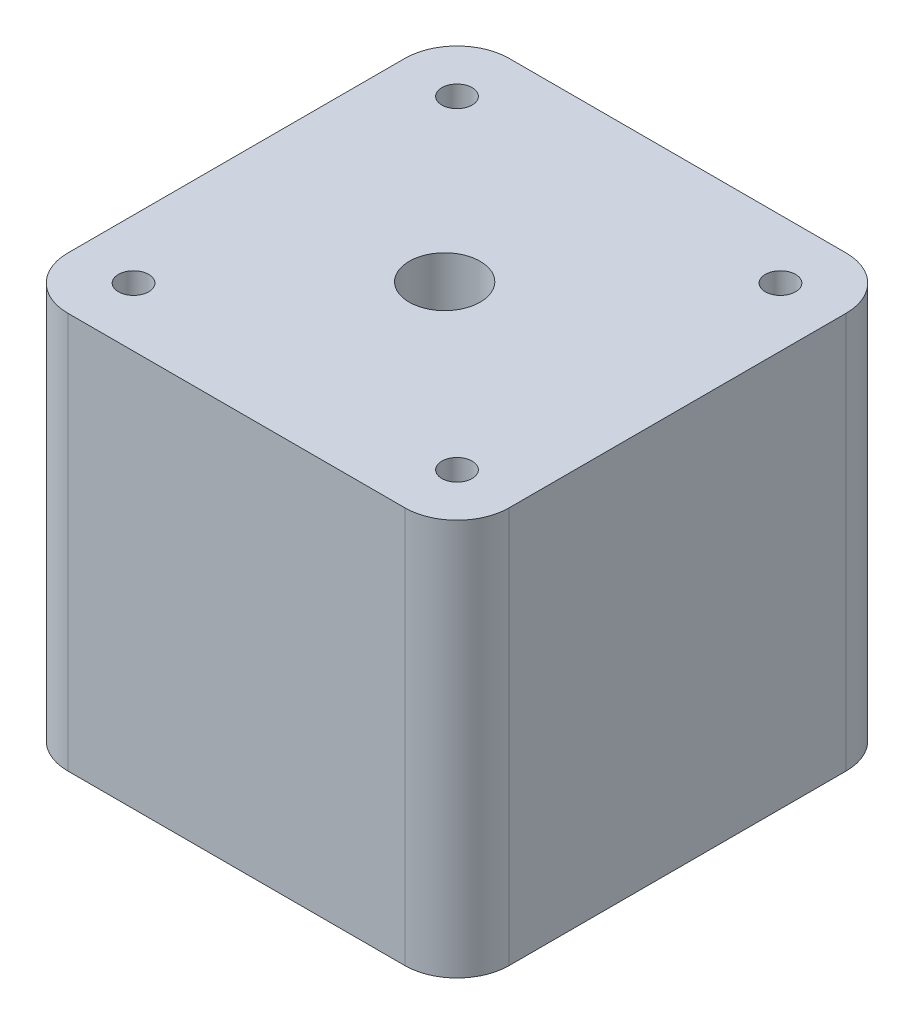
ISO-10303-21;
HEADER;
FILE_DESCRIPTION(('STEP AP214'),'2;1');
FILE_NAME('part.step','',(''),(''),'','','');
FILE_SCHEMA(('AUTOMOTIVE_DESIGN { 1 0 10303 214 1 1 1 1 }'));
ENDSEC;
DATA;
#1=APPLICATION_CONTEXT('core data for automotive mechanical design processes');
#2=APPLICATION_PROTOCOL_DEFINITION('international standard','automotive_design',2000,#1);
#3=PRODUCT_CONTEXT('',#1,'mechanical');
#4=PRODUCT('Part','Part','',(#3));
#5=PRODUCT_RELATED_PRODUCT_CATEGORY('part','',(#4));
#6=PRODUCT_DEFINITION_FORMATION('','',#4);
#7=PRODUCT_DEFINITION_CONTEXT('part definition',#1,'design');
#8=PRODUCT_DEFINITION('design','',#6,#7);
#9=PRODUCT_DEFINITION_SHAPE('','',#8);
#10=(LENGTH_UNIT() NAMED_UNIT(*) SI_UNIT(.MILLI.,.METRE.));
#11=(NAMED_UNIT(*) PLANE_ANGLE_UNIT() SI_UNIT($,.RADIAN.));
#12=(NAMED_UNIT(*) SI_UNIT($,.STERADIAN.) SOLID_ANGLE_UNIT());
#13=UNCERTAINTY_MEASURE_WITH_UNIT(LENGTH_MEASURE(1.E-05),#10,'distance_accuracy_value','');
#14=(GEOMETRIC_REPRESENTATION_CONTEXT(3) GLOBAL_UNCERTAINTY_ASSIGNED_CONTEXT((#13)) GLOBAL_UNIT_ASSIGNED_CONTEXT((#10,
#11,#12)) REPRESENTATION_CONTEXT('',''));
#15=CARTESIAN_POINT('',(0.,0.,0.));
#16=DIRECTION('',(0.,0.,1.));
#17=DIRECTION('',(1.,0.,0.));
#18=AXIS2_PLACEMENT_3D('',#15,#16,#17);
#19=CARTESIAN_POINT('',(-22.1398895339047,38.,27.3268437601062));
#20=DIRECTION('',(0.,-1.,0.));
#21=DIRECTION('',(0.,0.,-1.));
#22=AXIS2_PLACEMENT_3D('',#19,#20,#21);
#23=CYLINDRICAL_SURFACE('',#22,5.);
#24=CARTESIAN_POINT('',(-22.1398895339047,0.,27.3268437601062));
#25=DIRECTION('',(0.,1.,0.));
#26=DIRECTION('',(0.,0.,1.));
#27=AXIS2_PLACEMENT_3D('',#24,#25,#26);
#28=CIRCLE('',#27,5.);
#29=CARTESIAN_POINT('',(-27.1398895339047,0.,27.3268437601062));
#30=VERTEX_POINT('',#29);
#31=CARTESIAN_POINT('',(-22.1398895339046,0.,32.3268437601062));
#32=VERTEX_POINT('',#31);
#33=EDGE_CURVE('E134',#30,#32,#28,.T.);
#34=ORIENTED_EDGE('',*,*,#33,.T.);
#35=DIRECTION('',(0.,-1.,0.));
#36=VECTOR('',#35,1.);
#37=CARTESIAN_POINT('',(-22.1398895339046,38.,32.3268437601062));
#38=LINE('',#37,#36);
#39=CARTESIAN_POINT('',(-22.1398895339046,38.,32.3268437601062));
#40=VERTEX_POINT('',#39);
#41=EDGE_CURVE('E11',#40,#32,#38,.T.);
#42=ORIENTED_EDGE('',*,*,#41,.F.);
#43=CARTESIAN_POINT('',(-22.1398895339047,38.,27.3268437601062));
#44=DIRECTION('',(0.,1.,0.));
#45=DIRECTION('',(0.,0.,1.));
#46=AXIS2_PLACEMENT_3D('',#43,#44,#45);
#47=CIRCLE('',#46,5.);
#48=CARTESIAN_POINT('',(-27.1398895339047,38.,27.3268437601062));
#49=VERTEX_POINT('',#48);
#50=EDGE_CURVE('E149',#49,#40,#47,.T.);
#51=ORIENTED_EDGE('',*,*,#50,.F.);
#52=DIRECTION('',(0.,-1.,0.));
#53=VECTOR('',#52,1.);
#54=CARTESIAN_POINT('',(-27.1398895339047,38.,27.3268437601062));
#55=LINE('',#54,#53);
#56=EDGE_CURVE('E130',#49,#30,#55,.T.);
#57=ORIENTED_EDGE('',*,*,#56,.T.);
#58=EDGE_LOOP('',(#34,#42,#51,#57));
#59=FACE_BOUND('',#58,.T.);
#60=ADVANCED_FACE('F35',(#59),#23,.T.);
#61=CARTESIAN_POINT('',(-22.1398895339046,38.,32.3268437601062));
#62=DIRECTION('',(0.,0.,-1.));
#63=DIRECTION('',(-1.,0.,0.));
#64=AXIS2_PLACEMENT_3D('',#61,#62,#63);
#65=PLANE('',#64);
#66=DIRECTION('',(1.,0.,0.));
#67=VECTOR('',#66,1.);
#68=CARTESIAN_POINT('',(-22.1398895339046,0.,32.3268437601062));
#69=LINE('',#68,#67);
#70=CARTESIAN_POINT('',(10.1601104660953,0.,32.3268437601062));
#71=VERTEX_POINT('',#70);
#72=EDGE_CURVE('E137',#32,#71,#69,.T.);
#73=ORIENTED_EDGE('',*,*,#72,.T.);
#74=DIRECTION('',(0.,-1.,0.));
#75=VECTOR('',#74,1.);
#76=CARTESIAN_POINT('',(10.1601104660953,38.,32.3268437601062));
#77=LINE('',#76,#75);
#78=CARTESIAN_POINT('',(10.1601104660953,38.,32.3268437601062));
#79=VERTEX_POINT('',#78);
#80=EDGE_CURVE('E43',#79,#71,#77,.T.);
#81=ORIENTED_EDGE('',*,*,#80,.F.);
#82=DIRECTION('',(1.,0.,0.));
#83=VECTOR('',#82,1.);
#84=CARTESIAN_POINT('',(-22.1398895339046,38.,32.3268437601062));
#85=LINE('',#84,#83);
#86=EDGE_CURVE('E95',#40,#79,#85,.T.);
#87=ORIENTED_EDGE('',*,*,#86,.F.);
#88=ORIENTED_EDGE('',*,*,#41,.T.);
#89=EDGE_LOOP('',(#73,#81,#87,#88));
#90=FACE_BOUND('',#89,.T.);
#91=ADVANCED_FACE('F243',(#90),#65,.F.);
#92=CARTESIAN_POINT('',(10.1601104660953,38.,27.3268437601062));
#93=DIRECTION('',(0.,-1.,0.));
#94=DIRECTION('',(0.,0.,-1.));
#95=AXIS2_PLACEMENT_3D('',#92,#93,#94);
#96=CYLINDRICAL_SURFACE('',#95,5.);
#97=CARTESIAN_POINT('',(10.1601104660953,0.,27.3268437601062));
#98=DIRECTION('',(0.,1.,0.));
#99=DIRECTION('',(0.,0.,1.));
#100=AXIS2_PLACEMENT_3D('',#97,#98,#99);
#101=CIRCLE('',#100,5.);
#102=CARTESIAN_POINT('',(15.1601104660953,0.,27.3268437601062));
#103=VERTEX_POINT('',#102);
#104=EDGE_CURVE('E140',#71,#103,#101,.T.);
#105=ORIENTED_EDGE('',*,*,#104,.T.);
#106=DIRECTION('',(0.,-1.,0.));
#107=VECTOR('',#106,1.);
#108=CARTESIAN_POINT('',(15.1601104660953,38.,27.3268437601062));
#109=LINE('',#108,#107);
#110=CARTESIAN_POINT('',(15.1601104660953,38.,27.3268437601062));
#111=VERTEX_POINT('',#110);
#112=EDGE_CURVE('E156',#111,#103,#109,.T.);
#113=ORIENTED_EDGE('',*,*,#112,.F.);
#114=CARTESIAN_POINT('',(10.1601104660953,38.,27.3268437601062));
#115=DIRECTION('',(0.,1.,0.));
#116=DIRECTION('',(0.,0.,1.));
#117=AXIS2_PLACEMENT_3D('',#114,#115,#116);
#118=CIRCLE('',#117,5.);
#119=EDGE_CURVE('E164',#79,#111,#118,.T.);
#120=ORIENTED_EDGE('',*,*,#119,.F.);
#121=ORIENTED_EDGE('',*,*,#80,.T.);
#122=EDGE_LOOP('',(#105,#113,#120,#121));
#123=FACE_BOUND('',#122,.T.);
#124=ADVANCED_FACE('F162',(#123),#96,.T.);
#125=CARTESIAN_POINT('',(15.1601104660953,38.,-4.97315623989379));
#126=DIRECTION('',(-1.,0.,0.));
#127=DIRECTION('',(0.,0.,1.));
#128=AXIS2_PLACEMENT_3D('',#125,#126,#127);
#129=PLANE('',#128);
#130=DIRECTION('',(0.,0.,-1.));
#131=VECTOR('',#130,1.);
#132=CARTESIAN_POINT('',(15.1601104660953,0.,-4.97315623989379));
#133=LINE('',#132,#131);
#134=CARTESIAN_POINT('',(15.1601104660953,0.,-4.97315623989379));
#135=VERTEX_POINT('',#134);
#136=EDGE_CURVE('E142',#103,#135,#133,.T.);
#137=ORIENTED_EDGE('',*,*,#136,.T.);
#138=DIRECTION('',(0.,-1.,0.));
#139=VECTOR('',#138,1.);
#140=CARTESIAN_POINT('',(15.1601104660953,38.,-4.97315623989379));
#141=LINE('',#140,#139);
#142=CARTESIAN_POINT('',(15.1601104660953,38.,-4.97315623989379));
#143=VERTEX_POINT('',#142);
#144=EDGE_CURVE('E153',#143,#135,#141,.T.);
#145=ORIENTED_EDGE('',*,*,#144,.F.);
#146=DIRECTION('',(0.,0.,-1.));
#147=VECTOR('',#146,1.);
#148=CARTESIAN_POINT('',(15.1601104660953,38.,-4.97315623989379));
#149=LINE('',#148,#147);
#150=EDGE_CURVE('E176',#111,#143,#149,.T.);
#151=ORIENTED_EDGE('',*,*,#150,.F.);
#152=ORIENTED_EDGE('',*,*,#112,.T.);
#153=EDGE_LOOP('',(#137,#145,#151,#152));
#154=FACE_BOUND('',#153,.T.);
#155=ADVANCED_FACE('F172',(#154),#129,.F.);
#156=CARTESIAN_POINT('',(10.1601104660953,38.,-4.97315623989379));
#157=DIRECTION('',(0.,-1.,0.));
#158=DIRECTION('',(0.,0.,-1.));
#159=AXIS2_PLACEMENT_3D('',#156,#157,#158);
#160=CYLINDRICAL_SURFACE('',#159,5.);
#161=CARTESIAN_POINT('',(10.1601104660953,0.,-4.97315623989379));
#162=DIRECTION('',(0.,1.,0.));
#163=DIRECTION('',(0.,0.,-1.));
#164=AXIS2_PLACEMENT_3D('',#161,#162,#163);
#165=CIRCLE('',#164,5.);
#166=CARTESIAN_POINT('',(10.1601104660953,0.,-9.97315623989379));
#167=VERTEX_POINT('',#166);
#168=EDGE_CURVE('E144',#135,#167,#165,.T.);
#169=ORIENTED_EDGE('',*,*,#168,.T.);
#170=DIRECTION('',(0.,-1.,0.));
#171=VECTOR('',#170,1.);
#172=CARTESIAN_POINT('',(10.1601104660953,38.,-9.97315623989379));
#173=LINE('',#172,#171);
#174=CARTESIAN_POINT('',(10.1601104660953,38.,-9.97315623989379));
#175=VERTEX_POINT('',#174);
#176=EDGE_CURVE('E125',#175,#167,#173,.T.);
#177=ORIENTED_EDGE('',*,*,#176,.F.);
#178=CARTESIAN_POINT('',(10.1601104660953,38.,-4.97315623989379));
#179=DIRECTION('',(0.,1.,0.));
#180=DIRECTION('',(0.,0.,-1.));
#181=AXIS2_PLACEMENT_3D('',#178,#179,#180);
#182=CIRCLE('',#181,5.);
#183=EDGE_CURVE('E116',#143,#175,#182,.T.);
#184=ORIENTED_EDGE('',*,*,#183,.F.);
#185=ORIENTED_EDGE('',*,*,#144,.T.);
#186=EDGE_LOOP('',(#169,#177,#184,#185));
#187=FACE_BOUND('',#186,.T.);
#188=ADVANCED_FACE('F175',(#187),#160,.T.);
#189=CARTESIAN_POINT('',(-22.1398895339047,38.,-9.97315623989379));
#190=DIRECTION('',(0.,0.,1.));
#191=DIRECTION('',(1.,0.,0.));
#192=AXIS2_PLACEMENT_3D('',#189,#190,#191);
#193=PLANE('',#192);
#194=DIRECTION('',(-1.,0.,0.));
#195=VECTOR('',#194,1.);
#196=CARTESIAN_POINT('',(-22.1398895339047,0.,-9.97315623989379));
#197=LINE('',#196,#195);
#198=CARTESIAN_POINT('',(-22.1398895339047,0.,-9.97315623989379));
#199=VERTEX_POINT('',#198);
#200=EDGE_CURVE('E124',#167,#199,#197,.T.);
#201=ORIENTED_EDGE('',*,*,#200,.T.);
#202=DIRECTION('',(0.,-1.,0.));
#203=VECTOR('',#202,1.);
#204=CARTESIAN_POINT('',(-22.1398895339047,38.,-9.97315623989379));
#205=LINE('',#204,#203);
#206=CARTESIAN_POINT('',(-22.1398895339047,38.,-9.97315623989379));
#207=VERTEX_POINT('',#206);
#208=EDGE_CURVE('E121',#207,#199,#205,.T.);
#209=ORIENTED_EDGE('',*,*,#208,.F.);
#210=DIRECTION('',(-1.,0.,0.));
#211=VECTOR('',#210,1.);
#212=CARTESIAN_POINT('',(-22.1398895339047,38.,-9.97315623989379));
#213=LINE('',#212,#211);
#214=EDGE_CURVE('E110',#175,#207,#213,.T.);
#215=ORIENTED_EDGE('',*,*,#214,.F.);
#216=ORIENTED_EDGE('',*,*,#176,.T.);
#217=EDGE_LOOP('',(#201,#209,#215,#216));
#218=FACE_BOUND('',#217,.T.);
#219=ADVANCED_FACE('F122',(#218),#193,.F.);
#220=CARTESIAN_POINT('',(-22.1398895339047,38.,-4.97315623989379));
#221=DIRECTION('',(0.,-1.,0.));
#222=DIRECTION('',(0.,0.,-1.));
#223=AXIS2_PLACEMENT_3D('',#220,#221,#222);
#224=CYLINDRICAL_SURFACE('',#223,5.);
#225=CARTESIAN_POINT('',(-22.1398895339047,0.,-4.97315623989379));
#226=DIRECTION('',(0.,1.,0.));
#227=DIRECTION('',(0.,0.,1.));
#228=AXIS2_PLACEMENT_3D('',#225,#226,#227);
#229=CIRCLE('',#228,5.);
#230=CARTESIAN_POINT('',(-27.1398895339047,0.,-4.97315623989379));
#231=VERTEX_POINT('',#230);
#232=EDGE_CURVE('E81',#199,#231,#229,.T.);
#233=ORIENTED_EDGE('',*,*,#232,.T.);
#234=DIRECTION('',(0.,-1.,0.));
#235=VECTOR('',#234,1.);
#236=CARTESIAN_POINT('',(-27.1398895339047,38.,-4.97315623989379));
#237=LINE('',#236,#235);
#238=CARTESIAN_POINT('',(-27.1398895339047,38.,-4.97315623989379));
#239=VERTEX_POINT('',#238);
#240=EDGE_CURVE('E126',#239,#231,#237,.T.);
#241=ORIENTED_EDGE('',*,*,#240,.F.);
#242=CARTESIAN_POINT('',(-22.1398895339047,38.,-4.97315623989379));
#243=DIRECTION('',(0.,1.,0.));
#244=DIRECTION('',(0.,0.,1.));
#245=AXIS2_PLACEMENT_3D('',#242,#243,#244);
#246=CIRCLE('',#245,5.);
#247=EDGE_CURVE('E114',#207,#239,#246,.T.);
#248=ORIENTED_EDGE('',*,*,#247,.F.);
#249=ORIENTED_EDGE('',*,*,#208,.T.);
#250=EDGE_LOOP('',(#233,#241,#248,#249));
#251=FACE_BOUND('',#250,.T.);
#252=ADVANCED_FACE('F128',(#251),#224,.T.);
#253=CARTESIAN_POINT('',(-27.1398895339047,38.,-4.97315623989379));
#254=DIRECTION('',(1.,0.,0.));
#255=DIRECTION('',(0.,0.,-1.));
#256=AXIS2_PLACEMENT_3D('',#253,#254,#255);
#257=PLANE('',#256);
#258=DIRECTION('',(0.,0.,1.));
#259=VECTOR('',#258,1.);
#260=CARTESIAN_POINT('',(-27.1398895339047,0.,-4.97315623989379));
#261=LINE('',#260,#259);
#262=EDGE_CURVE('E87',#231,#30,#261,.T.);
#263=ORIENTED_EDGE('',*,*,#262,.T.);
#264=ORIENTED_EDGE('',*,*,#56,.F.);
#265=DIRECTION('',(0.,0.,1.));
#266=VECTOR('',#265,1.);
#267=CARTESIAN_POINT('',(-27.1398895339047,38.,-4.97315623989379));
#268=LINE('',#267,#266);
#269=EDGE_CURVE('E51',#239,#49,#268,.T.);
#270=ORIENTED_EDGE('',*,*,#269,.F.);
#271=ORIENTED_EDGE('',*,*,#240,.T.);
#272=EDGE_LOOP('',(#263,#264,#270,#271));
#273=FACE_BOUND('',#272,.T.);
#274=ADVANCED_FACE('F216',(#273),#257,.F.);
#275=CARTESIAN_POINT('',(-22.1398895339047,38.,27.3268437601062));
#276=DIRECTION('',(0.,1.,0.));
#277=DIRECTION('',(0.,0.,1.));
#278=AXIS2_PLACEMENT_3D('',#275,#276,#277);
#279=PLANE('',#278);
#280=CARTESIAN_POINT('',(-6.693665391643,38.,11.6550677812531));
#281=DIRECTION('',(0.,1.,0.));
#282=DIRECTION('',(0.,0.,1.));
#283=AXIS2_PLACEMENT_3D('',#280,#281,#282);
#284=CIRCLE('',#283,3.4);
#285=CARTESIAN_POINT('',(-6.693665391643,38.,15.0550677812531));
#286=VERTEX_POINT('',#285);
#287=EDGE_CURVE('E208',#286,#286,#284,.T.);
#288=ORIENTED_EDGE('',*,*,#287,.F.);
#289=EDGE_LOOP('',(#288));
#290=FACE_BOUND('',#289,.T.);
#291=CARTESIAN_POINT('',(-21.4898895339047,38.,26.6768437601062));
#292=DIRECTION('',(0.,1.,0.));
#293=DIRECTION('',(0.,0.,1.));
#294=AXIS2_PLACEMENT_3D('',#291,#292,#293);
#295=CIRCLE('',#294,1.44999999999999);
#296=CARTESIAN_POINT('',(-21.4898895339047,38.,28.1268437601062));
#297=VERTEX_POINT('',#296);
#298=EDGE_CURVE('E202',#297,#297,#295,.T.);
#299=ORIENTED_EDGE('',*,*,#298,.F.);
#300=EDGE_LOOP('',(#299));
#301=FACE_BOUND('',#300,.T.);
#302=CARTESIAN_POINT('',(-21.4898895339047,38.,-4.32315623989379));
#303=DIRECTION('',(0.,1.,0.));
#304=DIRECTION('',(0.,0.,1.));
#305=AXIS2_PLACEMENT_3D('',#302,#303,#304);
#306=CIRCLE('',#305,1.44999999999999);
#307=CARTESIAN_POINT('',(-21.4898895339047,38.,-2.8731562398938));
#308=VERTEX_POINT('',#307);
#309=EDGE_CURVE('E196',#308,#308,#306,.T.);
#310=ORIENTED_EDGE('',*,*,#309,.F.);
#311=EDGE_LOOP('',(#310));
#312=FACE_BOUND('',#311,.T.);
#313=CARTESIAN_POINT('',(9.51011046609533,38.,-4.32315623989379));
#314=DIRECTION('',(0.,1.,0.));
#315=DIRECTION('',(0.,0.,1.));
#316=AXIS2_PLACEMENT_3D('',#313,#314,#315);
#317=CIRCLE('',#316,1.44999999999999);
#318=CARTESIAN_POINT('',(9.51011046609533,38.,-2.8731562398938));
#319=VERTEX_POINT('',#318);
#320=EDGE_CURVE('E190',#319,#319,#317,.T.);
#321=ORIENTED_EDGE('',*,*,#320,.F.);
#322=EDGE_LOOP('',(#321));
#323=FACE_BOUND('',#322,.T.);
#324=CARTESIAN_POINT('',(9.51011046609533,38.,26.6768437601062));
#325=DIRECTION('',(0.,1.,0.));
#326=DIRECTION('',(0.,0.,1.));
#327=AXIS2_PLACEMENT_3D('',#324,#325,#326);
#328=CIRCLE('',#327,1.44999999999999);
#329=CARTESIAN_POINT('',(9.51011046609533,38.,28.1268437601062));
#330=VERTEX_POINT('',#329);
#331=EDGE_CURVE('E184',#330,#330,#328,.T.);
#332=ORIENTED_EDGE('',*,*,#331,.F.);
#333=EDGE_LOOP('',(#332));
#334=FACE_BOUND('',#333,.T.);
#335=ORIENTED_EDGE('',*,*,#50,.T.);
#336=ORIENTED_EDGE('',*,*,#86,.T.);
#337=ORIENTED_EDGE('',*,*,#119,.T.);
#338=ORIENTED_EDGE('',*,*,#150,.T.);
#339=ORIENTED_EDGE('',*,*,#183,.T.);
#340=ORIENTED_EDGE('',*,*,#214,.T.);
#341=ORIENTED_EDGE('',*,*,#247,.T.);
#342=ORIENTED_EDGE('',*,*,#269,.T.);
#343=EDGE_LOOP('',(#335,#336,#337,#338,#339,#340,#341,#342));
#344=FACE_BOUND('',#343,.T.);
#345=ADVANCED_FACE('F112',(#290,#301,#312,#323,#334,#344),#279,.T.);
#346=CARTESIAN_POINT('',(-22.1398895339047,0.,27.3268437601062));
#347=DIRECTION('',(0.,1.,0.));
#348=DIRECTION('',(0.,0.,1.));
#349=AXIS2_PLACEMENT_3D('',#346,#347,#348);
#350=PLANE('',#349);
#351=CARTESIAN_POINT('',(-6.693665391643,0.,11.6550677812531));
#352=DIRECTION('',(0.,1.,0.));
#353=DIRECTION('',(0.,0.,1.));
#354=AXIS2_PLACEMENT_3D('',#351,#352,#353);
#355=CIRCLE('',#354,3.39999999999999);
#356=CARTESIAN_POINT('',(-6.693665391643,0.,15.0550677812531));
#357=VERTEX_POINT('',#356);
#358=EDGE_CURVE('E205',#357,#357,#355,.T.);
#359=ORIENTED_EDGE('',*,*,#358,.T.);
#360=EDGE_LOOP('',(#359));
#361=FACE_BOUND('',#360,.T.);
#362=ORIENTED_EDGE('',*,*,#33,.F.);
#363=ORIENTED_EDGE('',*,*,#262,.F.);
#364=ORIENTED_EDGE('',*,*,#232,.F.);
#365=ORIENTED_EDGE('',*,*,#200,.F.);
#366=ORIENTED_EDGE('',*,*,#168,.F.);
#367=ORIENTED_EDGE('',*,*,#136,.F.);
#368=ORIENTED_EDGE('',*,*,#104,.F.);
#369=ORIENTED_EDGE('',*,*,#72,.F.);
#370=EDGE_LOOP('',(#362,#363,#364,#365,#366,#367,#368,#369));
#371=FACE_BOUND('',#370,.T.);
#372=ADVANCED_FACE('F168',(#361,#371),#350,.F.);
#373=CARTESIAN_POINT('',(9.51011046609533,33.5,26.6768437601062));
#374=DIRECTION('',(0.,1.,0.));
#375=DIRECTION('',(0.,0.,1.));
#376=AXIS2_PLACEMENT_3D('',#373,#374,#375);
#377=CONICAL_SURFACE('',#376,1.45,1.02974425867665);
#378=CARTESIAN_POINT('',(9.51011046609533,32.62875210241,26.6768437601062));
#379=VERTEX_POINT('',#378);
#380=VERTEX_LOOP('',#379);
#381=FACE_BOUND('',#380,.T.);
#382=CARTESIAN_POINT('',(9.51011046609533,33.5,26.6768437601062));
#383=DIRECTION('',(0.,1.,0.));
#384=DIRECTION('',(0.,0.,1.));
#385=AXIS2_PLACEMENT_3D('',#382,#383,#384);
#386=CIRCLE('',#385,1.45);
#387=CARTESIAN_POINT('',(9.51011046609533,33.5,28.1268437601062));
#388=VERTEX_POINT('',#387);
#389=EDGE_CURVE('E138',#388,#388,#386,.T.);
#390=ORIENTED_EDGE('',*,*,#389,.T.);
#391=EDGE_LOOP('',(#390));
#392=FACE_BOUND('',#391,.T.);
#393=ADVANCED_FACE('F229',(#381,#392),#377,.F.);
#394=CARTESIAN_POINT('',(9.51011046609533,38.,26.6768437601062));
#395=DIRECTION('',(0.,1.,0.));
#396=DIRECTION('',(0.,0.,1.));
#397=AXIS2_PLACEMENT_3D('',#394,#395,#396);
#398=CYLINDRICAL_SURFACE('',#397,1.44999999999999);
#399=ORIENTED_EDGE('',*,*,#389,.F.);
#400=EDGE_LOOP('',(#399));
#401=FACE_BOUND('',#400,.T.);
#402=ORIENTED_EDGE('',*,*,#331,.T.);
#403=EDGE_LOOP('',(#402));
#404=FACE_BOUND('',#403,.T.);
#405=ADVANCED_FACE('F226',(#401,#404),#398,.F.);
#406=CARTESIAN_POINT('',(9.51011046609533,33.5,-4.32315623989379));
#407=DIRECTION('',(0.,1.,0.));
#408=DIRECTION('',(0.,0.,1.));
#409=AXIS2_PLACEMENT_3D('',#406,#407,#408);
#410=CONICAL_SURFACE('',#409,1.45,1.02974425867665);
#411=CARTESIAN_POINT('',(9.51011046609533,32.62875210241,-4.32315623989379));
#412=VERTEX_POINT('',#411);
#413=VERTEX_LOOP('',#412);
#414=FACE_BOUND('',#413,.T.);
#415=CARTESIAN_POINT('',(9.51011046609533,33.5,-4.32315623989379));
#416=DIRECTION('',(0.,1.,0.));
#417=DIRECTION('',(0.,0.,1.));
#418=AXIS2_PLACEMENT_3D('',#415,#416,#417);
#419=CIRCLE('',#418,1.45);
#420=CARTESIAN_POINT('',(9.51011046609533,33.5,-2.87315623989379));
#421=VERTEX_POINT('',#420);
#422=EDGE_CURVE('E187',#421,#421,#419,.T.);
#423=ORIENTED_EDGE('',*,*,#422,.T.);
#424=EDGE_LOOP('',(#423));
#425=FACE_BOUND('',#424,.T.);
#426=ADVANCED_FACE('F228',(#414,#425),#410,.F.);
#427=CARTESIAN_POINT('',(9.51011046609533,38.,-4.32315623989379));
#428=DIRECTION('',(0.,1.,0.));
#429=DIRECTION('',(0.,0.,1.));
#430=AXIS2_PLACEMENT_3D('',#427,#428,#429);
#431=CYLINDRICAL_SURFACE('',#430,1.44999999999999);
#432=ORIENTED_EDGE('',*,*,#422,.F.);
#433=EDGE_LOOP('',(#432));
#434=FACE_BOUND('',#433,.T.);
#435=ORIENTED_EDGE('',*,*,#320,.T.);
#436=EDGE_LOOP('',(#435));
#437=FACE_BOUND('',#436,.T.);
#438=ADVANCED_FACE('F236',(#434,#437),#431,.F.);
#439=CARTESIAN_POINT('',(-21.4898895339047,33.5,-4.32315623989379));
#440=DIRECTION('',(0.,1.,0.));
#441=DIRECTION('',(0.,0.,1.));
#442=AXIS2_PLACEMENT_3D('',#439,#440,#441);
#443=CONICAL_SURFACE('',#442,1.45,1.02974425867665);
#444=CARTESIAN_POINT('',(-21.4898895339047,32.62875210241,-4.32315623989379));
#445=VERTEX_POINT('',#444);
#446=VERTEX_LOOP('',#445);
#447=FACE_BOUND('',#446,.T.);
#448=CARTESIAN_POINT('',(-21.4898895339047,33.5,-4.32315623989379));
#449=DIRECTION('',(0.,1.,0.));
#450=DIRECTION('',(0.,0.,1.));
#451=AXIS2_PLACEMENT_3D('',#448,#449,#450);
#452=CIRCLE('',#451,1.45);
#453=CARTESIAN_POINT('',(-21.4898895339047,33.5,-2.87315623989379));
#454=VERTEX_POINT('',#453);
#455=EDGE_CURVE('E193',#454,#454,#452,.T.);
#456=ORIENTED_EDGE('',*,*,#455,.T.);
#457=EDGE_LOOP('',(#456));
#458=FACE_BOUND('',#457,.T.);
#459=ADVANCED_FACE('F321',(#447,#458),#443,.F.);
#460=CARTESIAN_POINT('',(-21.4898895339047,38.,-4.32315623989379));
#461=DIRECTION('',(0.,1.,0.));
#462=DIRECTION('',(0.,0.,1.));
#463=AXIS2_PLACEMENT_3D('',#460,#461,#462);
#464=CYLINDRICAL_SURFACE('',#463,1.44999999999999);
#465=ORIENTED_EDGE('',*,*,#455,.F.);
#466=EDGE_LOOP('',(#465));
#467=FACE_BOUND('',#466,.T.);
#468=ORIENTED_EDGE('',*,*,#309,.T.);
#469=EDGE_LOOP('',(#468));
#470=FACE_BOUND('',#469,.T.);
#471=ADVANCED_FACE('F332',(#467,#470),#464,.F.);
#472=CARTESIAN_POINT('',(-21.4898895339047,33.5,26.6768437601062));
#473=DIRECTION('',(0.,1.,0.));
#474=DIRECTION('',(0.,0.,1.));
#475=AXIS2_PLACEMENT_3D('',#472,#473,#474);
#476=CONICAL_SURFACE('',#475,1.45,1.02974425867665);
#477=CARTESIAN_POINT('',(-21.4898895339047,32.62875210241,26.6768437601062));
#478=VERTEX_POINT('',#477);
#479=VERTEX_LOOP('',#478);
#480=FACE_BOUND('',#479,.T.);
#481=CARTESIAN_POINT('',(-21.4898895339047,33.5,26.6768437601062));
#482=DIRECTION('',(0.,1.,0.));
#483=DIRECTION('',(0.,0.,1.));
#484=AXIS2_PLACEMENT_3D('',#481,#482,#483);
#485=CIRCLE('',#484,1.45);
#486=CARTESIAN_POINT('',(-21.4898895339047,33.5,28.1268437601062));
#487=VERTEX_POINT('',#486);
#488=EDGE_CURVE('E199',#487,#487,#485,.T.);
#489=ORIENTED_EDGE('',*,*,#488,.T.);
#490=EDGE_LOOP('',(#489));
#491=FACE_BOUND('',#490,.T.);
#492=ADVANCED_FACE('F342',(#480,#491),#476,.F.);
#493=CARTESIAN_POINT('',(-21.4898895339047,38.,26.6768437601062));
#494=DIRECTION('',(0.,1.,0.));
#495=DIRECTION('',(0.,0.,1.));
#496=AXIS2_PLACEMENT_3D('',#493,#494,#495);
#497=CYLINDRICAL_SURFACE('',#496,1.44999999999999);
#498=ORIENTED_EDGE('',*,*,#488,.F.);
#499=EDGE_LOOP('',(#498));
#500=FACE_BOUND('',#499,.T.);
#501=ORIENTED_EDGE('',*,*,#298,.T.);
#502=EDGE_LOOP('',(#501));
#503=FACE_BOUND('',#502,.T.);
#504=ADVANCED_FACE('F353',(#500,#503),#497,.F.);
#505=CARTESIAN_POINT('',(-6.693665391643,38.,11.6550677812531));
#506=DIRECTION('',(0.,1.,0.));
#507=DIRECTION('',(0.,0.,1.));
#508=AXIS2_PLACEMENT_3D('',#505,#506,#507);
#509=CYLINDRICAL_SURFACE('',#508,3.4);
#510=ORIENTED_EDGE('',*,*,#358,.F.);
#511=EDGE_LOOP('',(#510));
#512=FACE_BOUND('',#511,.T.);
#513=ORIENTED_EDGE('',*,*,#287,.T.);
#514=EDGE_LOOP('',(#513));
#515=FACE_BOUND('',#514,.T.);
#516=ADVANCED_FACE('F212',(#512,#515),#509,.F.);
#517=CLOSED_SHELL('',(#60,#91,#124,#155,#188,#219,#252,#274,#345,#372,#393,#405,#426,#438,#459,
#471,#492,#504,#516));
#518=MANIFOLD_SOLID_BREP('B2',#517);
#519=ADVANCED_BREP_SHAPE_REPRESENTATION('',(#18,#518),#14);
#520=SHAPE_DEFINITION_REPRESENTATION(#9,#519);
ENDSEC;
END-ISO-10303-21;
